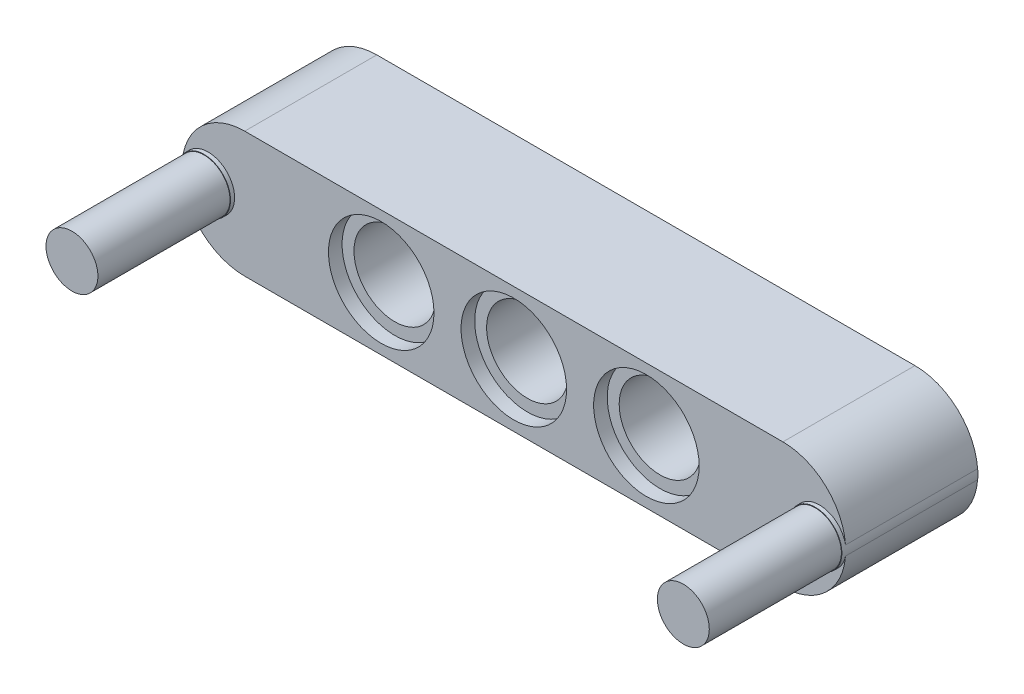
ISO-10303-21;
HEADER;
FILE_DESCRIPTION(('STEP AP214'),'2;1');
FILE_NAME('part.step','',(''),(''),'','','');
FILE_SCHEMA(('AUTOMOTIVE_DESIGN { 1 0 10303 214 1 1 1 1 }'));
ENDSEC;
DATA;
#1=APPLICATION_CONTEXT('core data for automotive mechanical design processes');
#2=APPLICATION_PROTOCOL_DEFINITION('international standard','automotive_design',2000,#1);
#3=PRODUCT_CONTEXT('',#1,'mechanical');
#4=PRODUCT('Part','Part','',(#3));
#5=PRODUCT_RELATED_PRODUCT_CATEGORY('part','',(#4));
#6=PRODUCT_DEFINITION_FORMATION('','',#4);
#7=PRODUCT_DEFINITION_CONTEXT('part definition',#1,'design');
#8=PRODUCT_DEFINITION('design','',#6,#7);
#9=PRODUCT_DEFINITION_SHAPE('','',#8);
#10=(LENGTH_UNIT() NAMED_UNIT(*) SI_UNIT(.MILLI.,.METRE.));
#11=(NAMED_UNIT(*) PLANE_ANGLE_UNIT() SI_UNIT($,.RADIAN.));
#12=(NAMED_UNIT(*) SI_UNIT($,.STERADIAN.) SOLID_ANGLE_UNIT());
#13=UNCERTAINTY_MEASURE_WITH_UNIT(LENGTH_MEASURE(1.E-05),#10,'distance_accuracy_value','');
#14=(GEOMETRIC_REPRESENTATION_CONTEXT(3) GLOBAL_UNCERTAINTY_ASSIGNED_CONTEXT((#13)) GLOBAL_UNIT_ASSIGNED_CONTEXT((#10,
#11,#12)) REPRESENTATION_CONTEXT('',''));
#15=CARTESIAN_POINT('',(0.,0.,0.));
#16=DIRECTION('',(0.,0.,1.));
#17=DIRECTION('',(1.,0.,0.));
#18=AXIS2_PLACEMENT_3D('',#15,#16,#17);
#19=CARTESIAN_POINT('',(35.31,3.69,7.76));
#20=DIRECTION('',(0.,0.,1.));
#21=DIRECTION('',(1.,0.,0.));
#22=AXIS2_PLACEMENT_3D('',#19,#20,#21);
#23=CYLINDRICAL_SURFACE('',#22,3.69);
#24=DIRECTION('',(0.,0.,-1.));
#25=VECTOR('',#24,1.);
#26=CARTESIAN_POINT('',(38.9892034883721,3.40793317963537,4.));
#27=LINE('',#26,#25);
#28=CARTESIAN_POINT('',(38.9892034883721,3.40793317963537,7.76));
#29=VERTEX_POINT('',#28);
#30=CARTESIAN_POINT('',(38.9892034883721,3.40793317963537,0.));
#31=VERTEX_POINT('',#30);
#32=EDGE_CURVE('E187',#29,#31,#27,.T.);
#33=ORIENTED_EDGE('',*,*,#32,.F.);
#34=CARTESIAN_POINT('',(35.31,3.69,7.76));
#35=DIRECTION('',(0.,0.,-1.));
#36=DIRECTION('',(-1.,0.,0.));
#37=AXIS2_PLACEMENT_3D('',#34,#35,#36);
#38=CIRCLE('',#37,3.69);
#39=CARTESIAN_POINT('',(35.31,0.,7.76));
#40=VERTEX_POINT('',#39);
#41=EDGE_CURVE('E153',#40,#29,#38,.F.);
#42=ORIENTED_EDGE('',*,*,#41,.F.);
#43=DIRECTION('',(0.,0.,1.));
#44=VECTOR('',#43,1.);
#45=CARTESIAN_POINT('',(35.31,0.,7.76));
#46=LINE('',#45,#44);
#47=CARTESIAN_POINT('',(35.31,0.,0.));
#48=VERTEX_POINT('',#47);
#49=EDGE_CURVE('E148',#48,#40,#46,.T.);
#50=ORIENTED_EDGE('',*,*,#49,.F.);
#51=CARTESIAN_POINT('',(35.31,3.69,0.));
#52=DIRECTION('',(0.,0.,-1.));
#53=DIRECTION('',(-1.,0.,0.));
#54=AXIS2_PLACEMENT_3D('',#51,#52,#53);
#55=CIRCLE('',#54,3.69);
#56=EDGE_CURVE('E151',#31,#48,#55,.T.);
#57=ORIENTED_EDGE('',*,*,#56,.F.);
#58=EDGE_LOOP('',(#33,#42,#50,#57));
#59=FACE_BOUND('',#58,.T.);
#60=ADVANCED_FACE('F39',(#59),#23,.T.);
#61=CARTESIAN_POINT('',(35.31,3.69,7.76));
#62=DIRECTION('',(0.,0.,1.));
#63=DIRECTION('',(1.,0.,0.));
#64=AXIS2_PLACEMENT_3D('',#61,#62,#63);
#65=CYLINDRICAL_SURFACE('',#64,3.69);
#66=DIRECTION('',(0.,0.,-1.));
#67=VECTOR('',#66,1.);
#68=CARTESIAN_POINT('',(38.9892034883721,3.97206682036463,4.));
#69=LINE('',#68,#67);
#70=CARTESIAN_POINT('',(38.9892034883721,3.97206682036463,0.));
#71=VERTEX_POINT('',#70);
#72=CARTESIAN_POINT('',(38.9892034883721,3.97206682036463,7.76));
#73=VERTEX_POINT('',#72);
#74=EDGE_CURVE('E61',#71,#73,#69,.F.);
#75=ORIENTED_EDGE('',*,*,#74,.F.);
#76=CARTESIAN_POINT('',(35.31,3.69,0.));
#77=DIRECTION('',(0.,0.,-1.));
#78=DIRECTION('',(-1.,0.,0.));
#79=AXIS2_PLACEMENT_3D('',#76,#77,#78);
#80=CIRCLE('',#79,3.69);
#81=CARTESIAN_POINT('',(35.31,7.38,0.));
#82=VERTEX_POINT('',#81);
#83=EDGE_CURVE('E143',#82,#71,#80,.T.);
#84=ORIENTED_EDGE('',*,*,#83,.F.);
#85=DIRECTION('',(0.,0.,1.));
#86=VECTOR('',#85,1.);
#87=CARTESIAN_POINT('',(35.31,7.38,7.76));
#88=LINE('',#87,#86);
#89=CARTESIAN_POINT('',(35.31,7.38,7.76));
#90=VERTEX_POINT('',#89);
#91=EDGE_CURVE('E140',#90,#82,#88,.F.);
#92=ORIENTED_EDGE('',*,*,#91,.F.);
#93=CARTESIAN_POINT('',(35.31,3.69,7.76));
#94=DIRECTION('',(0.,0.,-1.));
#95=DIRECTION('',(-1.,0.,0.));
#96=AXIS2_PLACEMENT_3D('',#93,#94,#95);
#97=CIRCLE('',#96,3.69);
#98=EDGE_CURVE('E146',#73,#90,#97,.F.);
#99=ORIENTED_EDGE('',*,*,#98,.F.);
#100=EDGE_LOOP('',(#75,#84,#92,#99));
#101=FACE_BOUND('',#100,.T.);
#102=ADVANCED_FACE('F177',(#101),#65,.T.);
#103=CARTESIAN_POINT('',(3.69,3.69,7.76));
#104=DIRECTION('',(0.,0.,-1.));
#105=DIRECTION('',(-1.,0.,0.));
#106=AXIS2_PLACEMENT_3D('',#103,#104,#105);
#107=CYLINDRICAL_SURFACE('',#106,3.69);
#108=DIRECTION('',(0.,0.,-1.));
#109=VECTOR('',#108,1.);
#110=CARTESIAN_POINT('',(0.010796511627908,3.40793317963534,4.));
#111=LINE('',#110,#109);
#112=CARTESIAN_POINT('',(0.0107965116279082,3.40793317963534,0.));
#113=VERTEX_POINT('',#112);
#114=CARTESIAN_POINT('',(0.0107965116279084,3.40793317963534,7.76));
#115=VERTEX_POINT('',#114);
#116=EDGE_CURVE('E53',#113,#115,#111,.F.);
#117=ORIENTED_EDGE('',*,*,#116,.F.);
#118=CARTESIAN_POINT('',(3.69,3.69,0.));
#119=DIRECTION('',(0.,0.,-1.));
#120=DIRECTION('',(-1.,0.,0.));
#121=AXIS2_PLACEMENT_3D('',#118,#119,#120);
#122=CIRCLE('',#121,3.69);
#123=CARTESIAN_POINT('',(3.69,0.,0.));
#124=VERTEX_POINT('',#123);
#125=EDGE_CURVE('E120',#124,#113,#122,.T.);
#126=ORIENTED_EDGE('',*,*,#125,.F.);
#127=DIRECTION('',(0.,0.,-1.));
#128=VECTOR('',#127,1.);
#129=CARTESIAN_POINT('',(3.69,0.,7.76));
#130=LINE('',#129,#128);
#131=CARTESIAN_POINT('',(3.69,0.,7.76));
#132=VERTEX_POINT('',#131);
#133=EDGE_CURVE('E129',#132,#124,#130,.T.);
#134=ORIENTED_EDGE('',*,*,#133,.F.);
#135=CARTESIAN_POINT('',(3.69,3.69,7.76));
#136=DIRECTION('',(0.,0.,-1.));
#137=DIRECTION('',(-1.,0.,0.));
#138=AXIS2_PLACEMENT_3D('',#135,#136,#137);
#139=CIRCLE('',#138,3.69);
#140=EDGE_CURVE('E137',#115,#132,#139,.F.);
#141=ORIENTED_EDGE('',*,*,#140,.F.);
#142=EDGE_LOOP('',(#117,#126,#134,#141));
#143=FACE_BOUND('',#142,.T.);
#144=ADVANCED_FACE('F183',(#143),#107,.T.);
#145=CARTESIAN_POINT('',(3.69,3.69,7.76));
#146=DIRECTION('',(0.,0.,1.));
#147=DIRECTION('',(1.,0.,0.));
#148=AXIS2_PLACEMENT_3D('',#145,#146,#147);
#149=CYLINDRICAL_SURFACE('',#148,3.69);
#150=DIRECTION('',(0.,0.,-1.));
#151=VECTOR('',#150,1.);
#152=CARTESIAN_POINT('',(0.0107965116279076,3.97206682036465,4.));
#153=LINE('',#152,#151);
#154=CARTESIAN_POINT('',(0.0107965116279071,3.97206682036465,7.76));
#155=VERTEX_POINT('',#154);
#156=CARTESIAN_POINT('',(0.0107965116279076,3.97206682036465,0.));
#157=VERTEX_POINT('',#156);
#158=EDGE_CURVE('E101',#155,#157,#153,.T.);
#159=ORIENTED_EDGE('',*,*,#158,.F.);
#160=CARTESIAN_POINT('',(3.69,3.69,7.76));
#161=DIRECTION('',(0.,0.,-1.));
#162=DIRECTION('',(-1.,0.,0.));
#163=AXIS2_PLACEMENT_3D('',#160,#161,#162);
#164=CIRCLE('',#163,3.69);
#165=CARTESIAN_POINT('',(3.69,7.38,7.76));
#166=VERTEX_POINT('',#165);
#167=EDGE_CURVE('E127',#166,#155,#164,.F.);
#168=ORIENTED_EDGE('',*,*,#167,.F.);
#169=DIRECTION('',(0.,0.,1.));
#170=VECTOR('',#169,1.);
#171=CARTESIAN_POINT('',(3.69,7.38,7.76));
#172=LINE('',#171,#170);
#173=CARTESIAN_POINT('',(3.69,7.38,0.));
#174=VERTEX_POINT('',#173);
#175=EDGE_CURVE('E126',#174,#166,#172,.T.);
#176=ORIENTED_EDGE('',*,*,#175,.F.);
#177=CARTESIAN_POINT('',(3.69,3.69,0.));
#178=DIRECTION('',(0.,0.,-1.));
#179=DIRECTION('',(-1.,0.,0.));
#180=AXIS2_PLACEMENT_3D('',#177,#178,#179);
#181=CIRCLE('',#180,3.69);
#182=EDGE_CURVE('E117',#157,#174,#181,.T.);
#183=ORIENTED_EDGE('',*,*,#182,.F.);
#184=EDGE_LOOP('',(#159,#168,#176,#183));
#185=FACE_BOUND('',#184,.T.);
#186=ADVANCED_FACE('F124',(#185),#149,.T.);
#187=CARTESIAN_POINT('',(27.29,3.69,0.));
#188=DIRECTION('',(0.,0.,1.));
#189=DIRECTION('',(1.,0.,0.));
#190=AXIS2_PLACEMENT_3D('',#187,#188,#189);
#191=CYLINDRICAL_SURFACE('',#190,3.1);
#192=CARTESIAN_POINT('',(27.29,3.69,0.));
#193=DIRECTION('',(0.,0.,1.));
#194=DIRECTION('',(1.,0.,0.));
#195=AXIS2_PLACEMENT_3D('',#192,#193,#194);
#196=CIRCLE('',#195,3.1);
#197=CARTESIAN_POINT('',(30.39,3.69,0.));
#198=VERTEX_POINT('',#197);
#199=EDGE_CURVE('E131',#198,#198,#196,.T.);
#200=ORIENTED_EDGE('',*,*,#199,.F.);
#201=EDGE_LOOP('',(#200));
#202=FACE_BOUND('',#201,.T.);
#203=CARTESIAN_POINT('',(27.29,3.69,0.8));
#204=DIRECTION('',(0.,0.,1.));
#205=DIRECTION('',(1.,0.,0.));
#206=AXIS2_PLACEMENT_3D('',#203,#204,#205);
#207=CIRCLE('',#206,3.1);
#208=CARTESIAN_POINT('',(30.39,3.69,0.8));
#209=VERTEX_POINT('',#208);
#210=EDGE_CURVE('E252',#209,#209,#207,.T.);
#211=ORIENTED_EDGE('',*,*,#210,.T.);
#212=EDGE_LOOP('',(#211));
#213=FACE_BOUND('',#212,.T.);
#214=ADVANCED_FACE('F258',(#202,#213),#191,.F.);
#215=CARTESIAN_POINT('',(7.79,0.,0.8));
#216=DIRECTION('',(0.,0.,1.));
#217=DIRECTION('',(1.,0.,0.));
#218=AXIS2_PLACEMENT_3D('',#215,#216,#217);
#219=PLANE('',#218);
#220=ORIENTED_EDGE('',*,*,#210,.F.);
#221=EDGE_LOOP('',(#220));
#222=FACE_BOUND('',#221,.T.);
#223=CARTESIAN_POINT('',(27.29,3.69,0.8));
#224=DIRECTION('',(0.,0.,1.));
#225=DIRECTION('',(1.,0.,0.));
#226=AXIS2_PLACEMENT_3D('',#223,#224,#225);
#227=CIRCLE('',#226,2.4);
#228=CARTESIAN_POINT('',(29.69,3.69,0.8));
#229=VERTEX_POINT('',#228);
#230=EDGE_CURVE('E243',#229,#229,#227,.F.);
#231=ORIENTED_EDGE('',*,*,#230,.F.);
#232=EDGE_LOOP('',(#231));
#233=FACE_BOUND('',#232,.T.);
#234=ADVANCED_FACE('F261',(#222,#233),#219,.F.);
#235=CARTESIAN_POINT('',(7.79,0.,6.95999999999999));
#236=DIRECTION('',(0.,0.,-1.));
#237=DIRECTION('',(-1.,0.,0.));
#238=AXIS2_PLACEMENT_3D('',#235,#236,#237);
#239=PLANE('',#238);
#240=CARTESIAN_POINT('',(27.29,3.69,6.96));
#241=DIRECTION('',(0.,0.,1.));
#242=DIRECTION('',(1.,0.,0.));
#243=AXIS2_PLACEMENT_3D('',#240,#241,#242);
#244=CIRCLE('',#243,3.1);
#245=CARTESIAN_POINT('',(30.39,3.69,6.96));
#246=VERTEX_POINT('',#245);
#247=EDGE_CURVE('E249',#246,#246,#244,.T.);
#248=ORIENTED_EDGE('',*,*,#247,.T.);
#249=EDGE_LOOP('',(#248));
#250=FACE_BOUND('',#249,.T.);
#251=CARTESIAN_POINT('',(27.29,3.69,6.95999999999999));
#252=DIRECTION('',(0.,0.,-1.));
#253=DIRECTION('',(-1.,0.,0.));
#254=AXIS2_PLACEMENT_3D('',#251,#252,#253);
#255=CIRCLE('',#254,2.4);
#256=CARTESIAN_POINT('',(24.89,3.69,6.95999999999999));
#257=VERTEX_POINT('',#256);
#258=EDGE_CURVE('E240',#257,#257,#255,.F.);
#259=ORIENTED_EDGE('',*,*,#258,.F.);
#260=EDGE_LOOP('',(#259));
#261=FACE_BOUND('',#260,.T.);
#262=ADVANCED_FACE('F267',(#250,#261),#239,.F.);
#263=CARTESIAN_POINT('',(27.29,3.69,7.76));
#264=DIRECTION('',(0.,0.,-1.));
#265=DIRECTION('',(-1.,0.,0.));
#266=AXIS2_PLACEMENT_3D('',#263,#264,#265);
#267=CYLINDRICAL_SURFACE('',#266,3.1);
#268=CARTESIAN_POINT('',(27.29,3.69,7.76));
#269=DIRECTION('',(0.,0.,1.));
#270=DIRECTION('',(1.,0.,0.));
#271=AXIS2_PLACEMENT_3D('',#268,#269,#270);
#272=CIRCLE('',#271,3.1);
#273=CARTESIAN_POINT('',(30.39,3.69,7.76));
#274=VERTEX_POINT('',#273);
#275=EDGE_CURVE('E246',#274,#274,#272,.T.);
#276=ORIENTED_EDGE('',*,*,#275,.T.);
#277=EDGE_LOOP('',(#276));
#278=FACE_BOUND('',#277,.T.);
#279=ORIENTED_EDGE('',*,*,#247,.F.);
#280=EDGE_LOOP('',(#279));
#281=FACE_BOUND('',#280,.T.);
#282=ADVANCED_FACE('F274',(#278,#281),#267,.F.);
#283=CARTESIAN_POINT('',(27.29,3.69,0.));
#284=DIRECTION('',(0.,0.,1.));
#285=DIRECTION('',(1.,0.,0.));
#286=AXIS2_PLACEMENT_3D('',#283,#284,#285);
#287=CYLINDRICAL_SURFACE('',#286,2.4);
#288=ORIENTED_EDGE('',*,*,#258,.T.);
#289=EDGE_LOOP('',(#288));
#290=FACE_BOUND('',#289,.T.);
#291=ORIENTED_EDGE('',*,*,#230,.T.);
#292=EDGE_LOOP('',(#291));
#293=FACE_BOUND('',#292,.T.);
#294=ADVANCED_FACE('F271',(#290,#293),#287,.F.);
#295=CARTESIAN_POINT('',(11.71,3.69,7.76));
#296=DIRECTION('',(0.,0.,-1.));
#297=DIRECTION('',(-1.,0.,0.));
#298=AXIS2_PLACEMENT_3D('',#295,#296,#297);
#299=CYLINDRICAL_SURFACE('',#298,3.1);
#300=CARTESIAN_POINT('',(11.71,3.69,7.76));
#301=DIRECTION('',(0.,0.,1.));
#302=DIRECTION('',(1.,0.,0.));
#303=AXIS2_PLACEMENT_3D('',#300,#301,#302);
#304=CIRCLE('',#303,3.1);
#305=CARTESIAN_POINT('',(14.81,3.69,7.76));
#306=VERTEX_POINT('',#305);
#307=EDGE_CURVE('E237',#306,#306,#304,.T.);
#308=ORIENTED_EDGE('',*,*,#307,.T.);
#309=EDGE_LOOP('',(#308));
#310=FACE_BOUND('',#309,.T.);
#311=CARTESIAN_POINT('',(11.71,3.69,6.96));
#312=DIRECTION('',(0.,0.,1.));
#313=DIRECTION('',(1.,0.,0.));
#314=AXIS2_PLACEMENT_3D('',#311,#312,#313);
#315=CIRCLE('',#314,3.1);
#316=CARTESIAN_POINT('',(14.81,3.69,6.96));
#317=VERTEX_POINT('',#316);
#318=EDGE_CURVE('E228',#317,#317,#315,.T.);
#319=ORIENTED_EDGE('',*,*,#318,.F.);
#320=EDGE_LOOP('',(#319));
#321=FACE_BOUND('',#320,.T.);
#322=ADVANCED_FACE('F273',(#310,#321),#299,.F.);
#323=CARTESIAN_POINT('',(-7.79,0.,0.8));
#324=DIRECTION('',(0.,0.,1.));
#325=DIRECTION('',(1.,0.,0.));
#326=AXIS2_PLACEMENT_3D('',#323,#324,#325);
#327=PLANE('',#326);
#328=CARTESIAN_POINT('',(11.71,3.69,0.8));
#329=DIRECTION('',(0.,0.,1.));
#330=DIRECTION('',(1.,0.,0.));
#331=AXIS2_PLACEMENT_3D('',#328,#329,#330);
#332=CIRCLE('',#331,3.1);
#333=CARTESIAN_POINT('',(14.81,3.69,0.8));
#334=VERTEX_POINT('',#333);
#335=EDGE_CURVE('E234',#334,#334,#332,.T.);
#336=ORIENTED_EDGE('',*,*,#335,.F.);
#337=EDGE_LOOP('',(#336));
#338=FACE_BOUND('',#337,.T.);
#339=CARTESIAN_POINT('',(11.71,3.69,0.8));
#340=DIRECTION('',(0.,0.,1.));
#341=DIRECTION('',(1.,0.,0.));
#342=AXIS2_PLACEMENT_3D('',#339,#340,#341);
#343=CIRCLE('',#342,2.4);
#344=CARTESIAN_POINT('',(14.11,3.69,0.8));
#345=VERTEX_POINT('',#344);
#346=EDGE_CURVE('E225',#345,#345,#343,.F.);
#347=ORIENTED_EDGE('',*,*,#346,.F.);
#348=EDGE_LOOP('',(#347));
#349=FACE_BOUND('',#348,.T.);
#350=ADVANCED_FACE('F281',(#338,#349),#327,.F.);
#351=CARTESIAN_POINT('',(11.71,3.69,0.));
#352=DIRECTION('',(0.,0.,1.));
#353=DIRECTION('',(1.,0.,0.));
#354=AXIS2_PLACEMENT_3D('',#351,#352,#353);
#355=CYLINDRICAL_SURFACE('',#354,3.1);
#356=CARTESIAN_POINT('',(11.71,3.69,0.));
#357=DIRECTION('',(0.,0.,1.));
#358=DIRECTION('',(1.,0.,0.));
#359=AXIS2_PLACEMENT_3D('',#356,#357,#358);
#360=CIRCLE('',#359,3.1);
#361=CARTESIAN_POINT('',(14.81,3.69,0.));
#362=VERTEX_POINT('',#361);
#363=EDGE_CURVE('E231',#362,#362,#360,.T.);
#364=ORIENTED_EDGE('',*,*,#363,.F.);
#365=EDGE_LOOP('',(#364));
#366=FACE_BOUND('',#365,.T.);
#367=ORIENTED_EDGE('',*,*,#335,.T.);
#368=EDGE_LOOP('',(#367));
#369=FACE_BOUND('',#368,.T.);
#370=ADVANCED_FACE('F357',(#366,#369),#355,.F.);
#371=CARTESIAN_POINT('',(-7.79,0.,6.95999999999999));
#372=DIRECTION('',(0.,0.,-1.));
#373=DIRECTION('',(-1.,0.,0.));
#374=AXIS2_PLACEMENT_3D('',#371,#372,#373);
#375=PLANE('',#374);
#376=ORIENTED_EDGE('',*,*,#318,.T.);
#377=EDGE_LOOP('',(#376));
#378=FACE_BOUND('',#377,.T.);
#379=CARTESIAN_POINT('',(11.71,3.69,6.95999999999999));
#380=DIRECTION('',(0.,0.,-1.));
#381=DIRECTION('',(-1.,0.,0.));
#382=AXIS2_PLACEMENT_3D('',#379,#380,#381);
#383=CIRCLE('',#382,2.4);
#384=CARTESIAN_POINT('',(9.31,3.69,6.95999999999999));
#385=VERTEX_POINT('',#384);
#386=EDGE_CURVE('E205',#385,#385,#383,.F.);
#387=ORIENTED_EDGE('',*,*,#386,.F.);
#388=EDGE_LOOP('',(#387));
#389=FACE_BOUND('',#388,.T.);
#390=ADVANCED_FACE('F353',(#378,#389),#375,.F.);
#391=CARTESIAN_POINT('',(11.71,3.69,0.));
#392=DIRECTION('',(0.,0.,1.));
#393=DIRECTION('',(1.,0.,0.));
#394=AXIS2_PLACEMENT_3D('',#391,#392,#393);
#395=CYLINDRICAL_SURFACE('',#394,2.4);
#396=ORIENTED_EDGE('',*,*,#386,.T.);
#397=EDGE_LOOP('',(#396));
#398=FACE_BOUND('',#397,.T.);
#399=ORIENTED_EDGE('',*,*,#346,.T.);
#400=EDGE_LOOP('',(#399));
#401=FACE_BOUND('',#400,.T.);
#402=ADVANCED_FACE('F350',(#398,#401),#395,.F.);
#403=CARTESIAN_POINT('',(0.,0.,7.76));
#404=DIRECTION('',(0.,1.,0.));
#405=DIRECTION('',(0.,0.,1.));
#406=AXIS2_PLACEMENT_3D('',#403,#404,#405);
#407=PLANE('',#406);
#408=DIRECTION('',(1.,0.,0.));
#409=VECTOR('',#408,1.);
#410=CARTESIAN_POINT('',(0.,0.,0.));
#411=LINE('',#410,#409);
#412=EDGE_CURVE('E207',#124,#48,#411,.T.);
#413=ORIENTED_EDGE('',*,*,#412,.T.);
#414=ORIENTED_EDGE('',*,*,#49,.T.);
#415=DIRECTION('',(1.,0.,0.));
#416=VECTOR('',#415,1.);
#417=CARTESIAN_POINT('',(0.,0.,7.76));
#418=LINE('',#417,#416);
#419=EDGE_CURVE('E198',#132,#40,#418,.T.);
#420=ORIENTED_EDGE('',*,*,#419,.F.);
#421=ORIENTED_EDGE('',*,*,#133,.T.);
#422=EDGE_LOOP('',(#413,#414,#420,#421));
#423=FACE_BOUND('',#422,.T.);
#424=ADVANCED_FACE('F346',(#423),#407,.F.);
#425=CARTESIAN_POINT('',(0.,7.38,7.76));
#426=DIRECTION('',(0.,-1.,0.));
#427=DIRECTION('',(0.,0.,-1.));
#428=AXIS2_PLACEMENT_3D('',#425,#426,#427);
#429=PLANE('',#428);
#430=DIRECTION('',(-1.,0.,0.));
#431=VECTOR('',#430,1.);
#432=CARTESIAN_POINT('',(0.,7.38,7.76));
#433=LINE('',#432,#431);
#434=EDGE_CURVE('E202',#90,#166,#433,.T.);
#435=ORIENTED_EDGE('',*,*,#434,.F.);
#436=ORIENTED_EDGE('',*,*,#91,.T.);
#437=DIRECTION('',(-1.,0.,0.));
#438=VECTOR('',#437,1.);
#439=CARTESIAN_POINT('',(0.,7.38,0.));
#440=LINE('',#439,#438);
#441=EDGE_CURVE('E203',#82,#174,#440,.T.);
#442=ORIENTED_EDGE('',*,*,#441,.T.);
#443=ORIENTED_EDGE('',*,*,#175,.T.);
#444=EDGE_LOOP('',(#435,#436,#442,#443));
#445=FACE_BOUND('',#444,.T.);
#446=ADVANCED_FACE('F342',(#445),#429,.F.);
#447=CARTESIAN_POINT('',(0.,0.,7.76));
#448=DIRECTION('',(0.,0.,-1.));
#449=DIRECTION('',(-1.,0.,0.));
#450=AXIS2_PLACEMENT_3D('',#447,#448,#449);
#451=PLANE('',#450);
#452=ORIENTED_EDGE('',*,*,#275,.F.);
#453=EDGE_LOOP('',(#452));
#454=FACE_BOUND('',#453,.T.);
#455=ORIENTED_EDGE('',*,*,#307,.F.);
#456=EDGE_LOOP('',(#455));
#457=FACE_BOUND('',#456,.T.);
#458=CARTESIAN_POINT('',(19.5,3.69,7.76));
#459=DIRECTION('',(0.,0.,1.));
#460=DIRECTION('',(1.,0.,0.));
#461=AXIS2_PLACEMENT_3D('',#458,#459,#460);
#462=CIRCLE('',#461,3.1);
#463=CARTESIAN_POINT('',(22.6,3.69,7.76));
#464=VERTEX_POINT('',#463);
#465=EDGE_CURVE('E312',#464,#464,#462,.T.);
#466=ORIENTED_EDGE('',*,*,#465,.F.);
#467=EDGE_LOOP('',(#466));
#468=FACE_BOUND('',#467,.T.);
#469=ORIENTED_EDGE('',*,*,#167,.T.);
#470=CARTESIAN_POINT('',(1.54,3.69,7.76));
#471=DIRECTION('',(0.,0.,-1.));
#472=DIRECTION('',(-1.,0.,0.));
#473=AXIS2_PLACEMENT_3D('',#470,#471,#472);
#474=CIRCLE('',#473,1.555);
#475=EDGE_CURVE('E106',#155,#115,#474,.T.);
#476=ORIENTED_EDGE('',*,*,#475,.T.);
#477=ORIENTED_EDGE('',*,*,#140,.T.);
#478=ORIENTED_EDGE('',*,*,#419,.T.);
#479=ORIENTED_EDGE('',*,*,#41,.T.);
#480=CARTESIAN_POINT('',(37.46,3.69,7.76));
#481=DIRECTION('',(0.,0.,-1.));
#482=DIRECTION('',(-1.,0.,0.));
#483=AXIS2_PLACEMENT_3D('',#480,#481,#482);
#484=CIRCLE('',#483,1.555);
#485=EDGE_CURVE('E195',#29,#73,#484,.T.);
#486=ORIENTED_EDGE('',*,*,#485,.T.);
#487=ORIENTED_EDGE('',*,*,#98,.T.);
#488=ORIENTED_EDGE('',*,*,#434,.T.);
#489=EDGE_LOOP('',(#469,#476,#477,#478,#479,#486,#487,#488));
#490=FACE_BOUND('',#489,.T.);
#491=ADVANCED_FACE('F194',(#454,#457,#468,#490),#451,.F.);
#492=CARTESIAN_POINT('',(0.,0.,0.));
#493=DIRECTION('',(0.,0.,-1.));
#494=DIRECTION('',(-1.,0.,0.));
#495=AXIS2_PLACEMENT_3D('',#492,#493,#494);
#496=PLANE('',#495);
#497=ORIENTED_EDGE('',*,*,#125,.T.);
#498=CARTESIAN_POINT('',(1.54,3.69,0.));
#499=DIRECTION('',(0.,0.,-1.));
#500=DIRECTION('',(-1.,0.,0.));
#501=AXIS2_PLACEMENT_3D('',#498,#499,#500);
#502=CIRCLE('',#501,1.555);
#503=EDGE_CURVE('E105',#113,#157,#502,.T.);
#504=ORIENTED_EDGE('',*,*,#503,.T.);
#505=ORIENTED_EDGE('',*,*,#182,.T.);
#506=ORIENTED_EDGE('',*,*,#441,.F.);
#507=ORIENTED_EDGE('',*,*,#83,.T.);
#508=CARTESIAN_POINT('',(37.46,3.69,0.));
#509=DIRECTION('',(0.,0.,-1.));
#510=DIRECTION('',(-1.,0.,0.));
#511=AXIS2_PLACEMENT_3D('',#508,#509,#510);
#512=CIRCLE('',#511,1.555);
#513=EDGE_CURVE('E297',#71,#31,#512,.T.);
#514=ORIENTED_EDGE('',*,*,#513,.T.);
#515=ORIENTED_EDGE('',*,*,#56,.T.);
#516=ORIENTED_EDGE('',*,*,#412,.F.);
#517=EDGE_LOOP('',(#497,#504,#505,#506,#507,#514,#515,#516));
#518=FACE_BOUND('',#517,.T.);
#519=ORIENTED_EDGE('',*,*,#199,.T.);
#520=EDGE_LOOP('',(#519));
#521=FACE_BOUND('',#520,.T.);
#522=ORIENTED_EDGE('',*,*,#363,.T.);
#523=EDGE_LOOP('',(#522));
#524=FACE_BOUND('',#523,.T.);
#525=CARTESIAN_POINT('',(19.5,3.69,0.));
#526=DIRECTION('',(0.,0.,1.));
#527=DIRECTION('',(1.,0.,0.));
#528=AXIS2_PLACEMENT_3D('',#525,#526,#527);
#529=CIRCLE('',#528,3.1);
#530=CARTESIAN_POINT('',(22.6,3.69,0.));
#531=VERTEX_POINT('',#530);
#532=EDGE_CURVE('E221',#531,#531,#529,.T.);
#533=ORIENTED_EDGE('',*,*,#532,.T.);
#534=EDGE_LOOP('',(#533));
#535=FACE_BOUND('',#534,.T.);
#536=ADVANCED_FACE('F114',(#518,#521,#524,#535),#496,.T.);
#537=CARTESIAN_POINT('',(19.5,3.69,0.));
#538=DIRECTION('',(0.,0.,1.));
#539=DIRECTION('',(1.,0.,0.));
#540=AXIS2_PLACEMENT_3D('',#537,#538,#539);
#541=CYLINDRICAL_SURFACE('',#540,2.4);
#542=CARTESIAN_POINT('',(19.5,3.69,6.95999999999999));
#543=DIRECTION('',(0.,0.,-1.));
#544=DIRECTION('',(-1.,0.,0.));
#545=AXIS2_PLACEMENT_3D('',#542,#543,#544);
#546=CIRCLE('',#545,2.4);
#547=CARTESIAN_POINT('',(17.1,3.69,6.95999999999999));
#548=VERTEX_POINT('',#547);
#549=EDGE_CURVE('E218',#548,#548,#546,.F.);
#550=ORIENTED_EDGE('',*,*,#549,.T.);
#551=EDGE_LOOP('',(#550));
#552=FACE_BOUND('',#551,.T.);
#553=CARTESIAN_POINT('',(19.5,3.69,0.8));
#554=DIRECTION('',(0.,0.,1.));
#555=DIRECTION('',(1.,0.,0.));
#556=AXIS2_PLACEMENT_3D('',#553,#554,#555);
#557=CIRCLE('',#556,2.4);
#558=CARTESIAN_POINT('',(21.9,3.69,0.8));
#559=VERTEX_POINT('',#558);
#560=EDGE_CURVE('E214',#559,#559,#557,.F.);
#561=ORIENTED_EDGE('',*,*,#560,.T.);
#562=EDGE_LOOP('',(#561));
#563=FACE_BOUND('',#562,.T.);
#564=ADVANCED_FACE('F327',(#552,#563),#541,.F.);
#565=CARTESIAN_POINT('',(0.,0.,0.8));
#566=DIRECTION('',(0.,0.,1.));
#567=DIRECTION('',(1.,0.,0.));
#568=AXIS2_PLACEMENT_3D('',#565,#566,#567);
#569=PLANE('',#568);
#570=CARTESIAN_POINT('',(19.5,3.69,0.8));
#571=DIRECTION('',(0.,0.,1.));
#572=DIRECTION('',(1.,0.,0.));
#573=AXIS2_PLACEMENT_3D('',#570,#571,#572);
#574=CIRCLE('',#573,3.1);
#575=CARTESIAN_POINT('',(22.6,3.69,0.8));
#576=VERTEX_POINT('',#575);
#577=EDGE_CURVE('E210',#576,#576,#574,.T.);
#578=ORIENTED_EDGE('',*,*,#577,.F.);
#579=EDGE_LOOP('',(#578));
#580=FACE_BOUND('',#579,.T.);
#581=ORIENTED_EDGE('',*,*,#560,.F.);
#582=EDGE_LOOP('',(#581));
#583=FACE_BOUND('',#582,.T.);
#584=ADVANCED_FACE('F324',(#580,#583),#569,.F.);
#585=CARTESIAN_POINT('',(19.5,3.69,0.));
#586=DIRECTION('',(0.,0.,1.));
#587=DIRECTION('',(1.,0.,0.));
#588=AXIS2_PLACEMENT_3D('',#585,#586,#587);
#589=CYLINDRICAL_SURFACE('',#588,3.1);
#590=ORIENTED_EDGE('',*,*,#532,.F.);
#591=EDGE_LOOP('',(#590));
#592=FACE_BOUND('',#591,.T.);
#593=ORIENTED_EDGE('',*,*,#577,.T.);
#594=EDGE_LOOP('',(#593));
#595=FACE_BOUND('',#594,.T.);
#596=ADVANCED_FACE('F322',(#592,#595),#589,.F.);
#597=CARTESIAN_POINT('',(0.,0.,6.95999999999999));
#598=DIRECTION('',(0.,0.,-1.));
#599=DIRECTION('',(-1.,0.,0.));
#600=AXIS2_PLACEMENT_3D('',#597,#598,#599);
#601=PLANE('',#600);
#602=CARTESIAN_POINT('',(19.5,3.69,6.96));
#603=DIRECTION('',(0.,0.,1.));
#604=DIRECTION('',(1.,0.,0.));
#605=AXIS2_PLACEMENT_3D('',#602,#603,#604);
#606=CIRCLE('',#605,3.1);
#607=CARTESIAN_POINT('',(22.6,3.69,6.96));
#608=VERTEX_POINT('',#607);
#609=EDGE_CURVE('E222',#608,#608,#606,.T.);
#610=ORIENTED_EDGE('',*,*,#609,.T.);
#611=EDGE_LOOP('',(#610));
#612=FACE_BOUND('',#611,.T.);
#613=ORIENTED_EDGE('',*,*,#549,.F.);
#614=EDGE_LOOP('',(#613));
#615=FACE_BOUND('',#614,.T.);
#616=ADVANCED_FACE('F516',(#612,#615),#601,.F.);
#617=CARTESIAN_POINT('',(19.5,3.69,7.76));
#618=DIRECTION('',(0.,0.,-1.));
#619=DIRECTION('',(-1.,0.,0.));
#620=AXIS2_PLACEMENT_3D('',#617,#618,#619);
#621=CYLINDRICAL_SURFACE('',#620,3.1);
#622=ORIENTED_EDGE('',*,*,#465,.T.);
#623=EDGE_LOOP('',(#622));
#624=FACE_BOUND('',#623,.T.);
#625=ORIENTED_EDGE('',*,*,#609,.F.);
#626=EDGE_LOOP('',(#625));
#627=FACE_BOUND('',#626,.T.);
#628=ADVANCED_FACE('F500',(#624,#627),#621,.F.);
#629=CARTESIAN_POINT('',(37.46,3.69,8.));
#630=DIRECTION('',(0.,0.,-1.));
#631=DIRECTION('',(-1.,0.,0.));
#632=AXIS2_PLACEMENT_3D('',#629,#630,#631);
#633=CYLINDRICAL_SURFACE('',#632,1.555);
#634=CARTESIAN_POINT('',(37.46,3.69,8.));
#635=DIRECTION('',(0.,0.,-1.));
#636=DIRECTION('',(-1.,0.,0.));
#637=AXIS2_PLACEMENT_3D('',#634,#635,#636);
#638=CIRCLE('',#637,1.555);
#639=CARTESIAN_POINT('',(35.905,3.69,8.));
#640=VERTEX_POINT('',#639);
#641=EDGE_CURVE('E299',#640,#640,#638,.T.);
#642=ORIENTED_EDGE('',*,*,#641,.T.);
#643=EDGE_LOOP('',(#642));
#644=FACE_BOUND('',#643,.T.);
#645=ORIENTED_EDGE('',*,*,#485,.F.);
#646=ORIENTED_EDGE('',*,*,#32,.T.);
#647=ORIENTED_EDGE('',*,*,#513,.F.);
#648=ORIENTED_EDGE('',*,*,#74,.T.);
#649=EDGE_LOOP('',(#645,#646,#647,#648));
#650=FACE_BOUND('',#649,.T.);
#651=ADVANCED_FACE('F492',(#644,#650),#633,.T.);
#652=CARTESIAN_POINT('',(37.46,3.69,8.));
#653=DIRECTION('',(0.,0.,-1.));
#654=DIRECTION('',(-1.,0.,0.));
#655=AXIS2_PLACEMENT_3D('',#652,#653,#654);
#656=PLANE('',#655);
#657=CARTESIAN_POINT('',(37.46,3.69,8.));
#658=DIRECTION('',(0.,0.,-1.));
#659=DIRECTION('',(-1.,0.,0.));
#660=AXIS2_PLACEMENT_3D('',#657,#658,#659);
#661=CIRCLE('',#660,1.525);
#662=CARTESIAN_POINT('',(35.935,3.69,8.));
#663=VERTEX_POINT('',#662);
#664=EDGE_CURVE('E46',#663,#663,#661,.T.);
#665=ORIENTED_EDGE('',*,*,#664,.T.);
#666=EDGE_LOOP('',(#665));
#667=FACE_BOUND('',#666,.T.);
#668=ORIENTED_EDGE('',*,*,#641,.F.);
#669=EDGE_LOOP('',(#668));
#670=FACE_BOUND('',#669,.T.);
#671=ADVANCED_FACE('F158',(#667,#670),#656,.F.);
#672=CARTESIAN_POINT('',(37.46,3.69,15.76));
#673=DIRECTION('',(0.,0.,1.));
#674=DIRECTION('',(1.,0.,0.));
#675=AXIS2_PLACEMENT_3D('',#672,#673,#674);
#676=PLANE('',#675);
#677=CARTESIAN_POINT('',(37.46,3.69,15.76));
#678=DIRECTION('',(0.,0.,1.));
#679=DIRECTION('',(1.,0.,0.));
#680=AXIS2_PLACEMENT_3D('',#677,#678,#679);
#681=CIRCLE('',#680,1.525);
#682=CARTESIAN_POINT('',(38.985,3.69,15.76));
#683=VERTEX_POINT('',#682);
#684=EDGE_CURVE('E309',#683,#683,#681,.T.);
#685=ORIENTED_EDGE('',*,*,#684,.T.);
#686=EDGE_LOOP('',(#685));
#687=FACE_BOUND('',#686,.T.);
#688=ADVANCED_FACE('F163',(#687),#676,.T.);
#689=CARTESIAN_POINT('',(37.46,3.69,15.76));
#690=DIRECTION('',(0.,0.,-1.));
#691=DIRECTION('',(-1.,0.,0.));
#692=AXIS2_PLACEMENT_3D('',#689,#690,#691);
#693=CYLINDRICAL_SURFACE('',#692,1.525);
#694=ORIENTED_EDGE('',*,*,#684,.F.);
#695=EDGE_LOOP('',(#694));
#696=FACE_BOUND('',#695,.T.);
#697=ORIENTED_EDGE('',*,*,#664,.F.);
#698=EDGE_LOOP('',(#697));
#699=FACE_BOUND('',#698,.T.);
#700=ADVANCED_FACE('F161',(#696,#699),#693,.T.);
#701=CARTESIAN_POINT('',(1.54,3.69,8.));
#702=DIRECTION('',(0.,0.,-1.));
#703=DIRECTION('',(-1.,0.,0.));
#704=AXIS2_PLACEMENT_3D('',#701,#702,#703);
#705=CYLINDRICAL_SURFACE('',#704,1.555);
#706=ORIENTED_EDGE('',*,*,#503,.F.);
#707=ORIENTED_EDGE('',*,*,#116,.T.);
#708=ORIENTED_EDGE('',*,*,#475,.F.);
#709=ORIENTED_EDGE('',*,*,#158,.T.);
#710=EDGE_LOOP('',(#706,#707,#708,#709));
#711=FACE_BOUND('',#710,.T.);
#712=CARTESIAN_POINT('',(1.54,3.69,8.));
#713=DIRECTION('',(0.,0.,-1.));
#714=DIRECTION('',(-1.,0.,0.));
#715=AXIS2_PLACEMENT_3D('',#712,#713,#714);
#716=CIRCLE('',#715,1.555);
#717=CARTESIAN_POINT('',(-0.0150000000000005,3.69,8.));
#718=VERTEX_POINT('',#717);
#719=EDGE_CURVE('E121',#718,#718,#716,.T.);
#720=ORIENTED_EDGE('',*,*,#719,.T.);
#721=EDGE_LOOP('',(#720));
#722=FACE_BOUND('',#721,.T.);
#723=ADVANCED_FACE('F103',(#711,#722),#705,.T.);
#724=CARTESIAN_POINT('',(1.54,3.69,8.));
#725=DIRECTION('',(0.,0.,-1.));
#726=DIRECTION('',(-1.,0.,0.));
#727=AXIS2_PLACEMENT_3D('',#724,#725,#726);
#728=PLANE('',#727);
#729=CARTESIAN_POINT('',(1.54,3.69,8.));
#730=DIRECTION('',(0.,0.,-1.));
#731=DIRECTION('',(-1.,0.,0.));
#732=AXIS2_PLACEMENT_3D('',#729,#730,#731);
#733=CIRCLE('',#732,1.525);
#734=CARTESIAN_POINT('',(0.0149999999999998,3.69,8.));
#735=VERTEX_POINT('',#734);
#736=EDGE_CURVE('E12',#735,#735,#733,.T.);
#737=ORIENTED_EDGE('',*,*,#736,.T.);
#738=EDGE_LOOP('',(#737));
#739=FACE_BOUND('',#738,.T.);
#740=ORIENTED_EDGE('',*,*,#719,.F.);
#741=EDGE_LOOP('',(#740));
#742=FACE_BOUND('',#741,.T.);
#743=ADVANCED_FACE('F170',(#739,#742),#728,.F.);
#744=CARTESIAN_POINT('',(1.54,3.69,15.76));
#745=DIRECTION('',(0.,0.,1.));
#746=DIRECTION('',(1.,0.,0.));
#747=AXIS2_PLACEMENT_3D('',#744,#745,#746);
#748=PLANE('',#747);
#749=CARTESIAN_POINT('',(1.54,3.69,15.76));
#750=DIRECTION('',(0.,0.,1.));
#751=DIRECTION('',(1.,0.,0.));
#752=AXIS2_PLACEMENT_3D('',#749,#750,#751);
#753=CIRCLE('',#752,1.525);
#754=CARTESIAN_POINT('',(3.065,3.69,15.76));
#755=VERTEX_POINT('',#754);
#756=EDGE_CURVE('E190',#755,#755,#753,.T.);
#757=ORIENTED_EDGE('',*,*,#756,.T.);
#758=EDGE_LOOP('',(#757));
#759=FACE_BOUND('',#758,.T.);
#760=ADVANCED_FACE('F477',(#759),#748,.T.);
#761=CARTESIAN_POINT('',(1.54,3.69,15.76));
#762=DIRECTION('',(0.,0.,-1.));
#763=DIRECTION('',(-1.,0.,0.));
#764=AXIS2_PLACEMENT_3D('',#761,#762,#763);
#765=CYLINDRICAL_SURFACE('',#764,1.525);
#766=ORIENTED_EDGE('',*,*,#756,.F.);
#767=EDGE_LOOP('',(#766));
#768=FACE_BOUND('',#767,.T.);
#769=ORIENTED_EDGE('',*,*,#736,.F.);
#770=EDGE_LOOP('',(#769));
#771=FACE_BOUND('',#770,.T.);
#772=ADVANCED_FACE('F481',(#768,#771),#765,.T.);
#773=CLOSED_SHELL('',(#60,#102,#144,#186,#214,#234,#262,#282,#294,#322,#350,#370,#390,#402,#424,
#446,#491,#536,#564,#584,#596,#616,#628,#651,#671,#688,#700,#723,#743,#760,#772));
#774=MANIFOLD_SOLID_BREP('B2',#773);
#775=ADVANCED_BREP_SHAPE_REPRESENTATION('',(#18,#774),#14);
#776=SHAPE_DEFINITION_REPRESENTATION(#9,#775);
ENDSEC;
END-ISO-10303-21;
